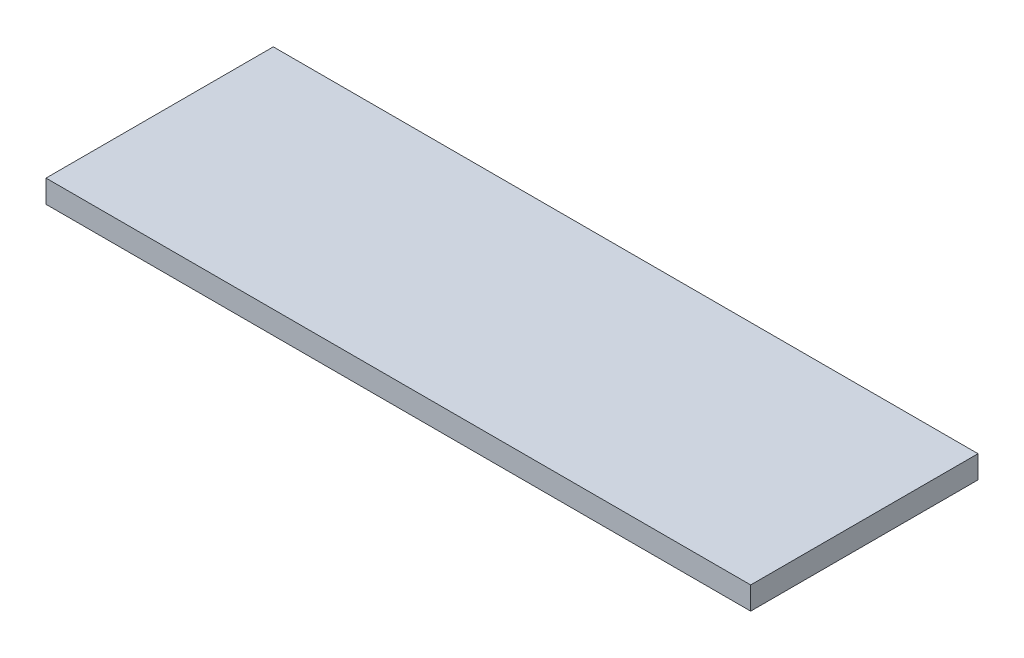
ISO-10303-21;
HEADER;
FILE_DESCRIPTION(('STEP AP214'),'2;1');
FILE_NAME('part.step','',(''),(''),'','','');
FILE_SCHEMA(('AUTOMOTIVE_DESIGN { 1 0 10303 214 1 1 1 1 }'));
ENDSEC;
DATA;
#1=APPLICATION_CONTEXT('core data for automotive mechanical design processes');
#2=APPLICATION_PROTOCOL_DEFINITION('international standard','automotive_design',2000,#1);
#3=PRODUCT_CONTEXT('',#1,'mechanical');
#4=PRODUCT('Part','Part','',(#3));
#5=PRODUCT_RELATED_PRODUCT_CATEGORY('part','',(#4));
#6=PRODUCT_DEFINITION_FORMATION('','',#4);
#7=PRODUCT_DEFINITION_CONTEXT('part definition',#1,'design');
#8=PRODUCT_DEFINITION('design','',#6,#7);
#9=PRODUCT_DEFINITION_SHAPE('','',#8);
#10=(LENGTH_UNIT() NAMED_UNIT(*) SI_UNIT(.MILLI.,.METRE.));
#11=(NAMED_UNIT(*) PLANE_ANGLE_UNIT() SI_UNIT($,.RADIAN.));
#12=(NAMED_UNIT(*) SI_UNIT($,.STERADIAN.) SOLID_ANGLE_UNIT());
#13=UNCERTAINTY_MEASURE_WITH_UNIT(LENGTH_MEASURE(1.E-05),#10,'distance_accuracy_value','');
#14=(GEOMETRIC_REPRESENTATION_CONTEXT(3) GLOBAL_UNCERTAINTY_ASSIGNED_CONTEXT((#13)) GLOBAL_UNIT_ASSIGNED_CONTEXT((#10,
#11,#12)) REPRESENTATION_CONTEXT('',''));
#15=CARTESIAN_POINT('',(0.,0.,0.));
#16=DIRECTION('',(0.,0.,1.));
#17=DIRECTION('',(1.,0.,0.));
#18=AXIS2_PLACEMENT_3D('',#15,#16,#17);
#19=CARTESIAN_POINT('',(-155.,10.,-50.));
#20=DIRECTION('',(1.,0.,0.));
#21=DIRECTION('',(0.,0.,-1.));
#22=AXIS2_PLACEMENT_3D('',#19,#20,#21);
#23=PLANE('',#22);
#24=DIRECTION('',(0.,0.,1.));
#25=VECTOR('',#24,1.);
#26=CARTESIAN_POINT('',(-155.,0.,-50.));
#27=LINE('',#26,#25);
#28=CARTESIAN_POINT('',(-155.,0.,-50.));
#29=VERTEX_POINT('',#28);
#30=CARTESIAN_POINT('',(-155.,0.,50.));
#31=VERTEX_POINT('',#30);
#32=EDGE_CURVE('E96',#29,#31,#27,.T.);
#33=ORIENTED_EDGE('',*,*,#32,.T.);
#34=DIRECTION('',(0.,-1.,0.));
#35=VECTOR('',#34,1.);
#36=CARTESIAN_POINT('',(-155.,10.,50.));
#37=LINE('',#36,#35);
#38=CARTESIAN_POINT('',(-155.,10.,50.));
#39=VERTEX_POINT('',#38);
#40=EDGE_CURVE('E11',#39,#31,#37,.T.);
#41=ORIENTED_EDGE('',*,*,#40,.F.);
#42=DIRECTION('',(0.,0.,1.));
#43=VECTOR('',#42,1.);
#44=CARTESIAN_POINT('',(-155.,10.,-50.));
#45=LINE('',#44,#43);
#46=CARTESIAN_POINT('',(-155.,10.,-50.));
#47=VERTEX_POINT('',#46);
#48=EDGE_CURVE('E84',#47,#39,#45,.T.);
#49=ORIENTED_EDGE('',*,*,#48,.F.);
#50=DIRECTION('',(0.,-1.,0.));
#51=VECTOR('',#50,1.);
#52=CARTESIAN_POINT('',(-155.,10.,-50.));
#53=LINE('',#52,#51);
#54=EDGE_CURVE('E92',#47,#29,#53,.T.);
#55=ORIENTED_EDGE('',*,*,#54,.T.);
#56=EDGE_LOOP('',(#33,#41,#49,#55));
#57=FACE_BOUND('',#56,.T.);
#58=ADVANCED_FACE('F33',(#57),#23,.F.);
#59=CARTESIAN_POINT('',(-155.,10.,50.));
#60=DIRECTION('',(0.,0.,-1.));
#61=DIRECTION('',(-1.,0.,0.));
#62=AXIS2_PLACEMENT_3D('',#59,#60,#61);
#63=PLANE('',#62);
#64=DIRECTION('',(1.,0.,0.));
#65=VECTOR('',#64,1.);
#66=CARTESIAN_POINT('',(-155.,0.,50.));
#67=LINE('',#66,#65);
#68=CARTESIAN_POINT('',(155.,0.,50.));
#69=VERTEX_POINT('',#68);
#70=EDGE_CURVE('E88',#31,#69,#67,.T.);
#71=ORIENTED_EDGE('',*,*,#70,.T.);
#72=DIRECTION('',(0.,-1.,0.));
#73=VECTOR('',#72,1.);
#74=CARTESIAN_POINT('',(155.,10.,50.));
#75=LINE('',#74,#73);
#76=CARTESIAN_POINT('',(155.,10.,50.));
#77=VERTEX_POINT('',#76);
#78=EDGE_CURVE('E41',#77,#69,#75,.T.);
#79=ORIENTED_EDGE('',*,*,#78,.F.);
#80=DIRECTION('',(1.,0.,0.));
#81=VECTOR('',#80,1.);
#82=CARTESIAN_POINT('',(-155.,10.,50.));
#83=LINE('',#82,#81);
#84=EDGE_CURVE('E79',#39,#77,#83,.T.);
#85=ORIENTED_EDGE('',*,*,#84,.F.);
#86=ORIENTED_EDGE('',*,*,#40,.T.);
#87=EDGE_LOOP('',(#71,#79,#85,#86));
#88=FACE_BOUND('',#87,.T.);
#89=ADVANCED_FACE('F87',(#88),#63,.F.);
#90=CARTESIAN_POINT('',(155.,10.,-50.));
#91=DIRECTION('',(-1.,0.,0.));
#92=DIRECTION('',(0.,0.,1.));
#93=AXIS2_PLACEMENT_3D('',#90,#91,#92);
#94=PLANE('',#93);
#95=DIRECTION('',(0.,0.,-1.));
#96=VECTOR('',#95,1.);
#97=CARTESIAN_POINT('',(155.,0.,-50.));
#98=LINE('',#97,#96);
#99=CARTESIAN_POINT('',(155.,0.,-50.));
#100=VERTEX_POINT('',#99);
#101=EDGE_CURVE('E66',#69,#100,#98,.T.);
#102=ORIENTED_EDGE('',*,*,#101,.T.);
#103=DIRECTION('',(0.,-1.,0.));
#104=VECTOR('',#103,1.);
#105=CARTESIAN_POINT('',(155.,10.,-50.));
#106=LINE('',#105,#104);
#107=CARTESIAN_POINT('',(155.,10.,-50.));
#108=VERTEX_POINT('',#107);
#109=EDGE_CURVE('E89',#108,#100,#106,.T.);
#110=ORIENTED_EDGE('',*,*,#109,.F.);
#111=DIRECTION('',(0.,0.,-1.));
#112=VECTOR('',#111,1.);
#113=CARTESIAN_POINT('',(155.,10.,-50.));
#114=LINE('',#113,#112);
#115=EDGE_CURVE('E82',#77,#108,#114,.T.);
#116=ORIENTED_EDGE('',*,*,#115,.F.);
#117=ORIENTED_EDGE('',*,*,#78,.T.);
#118=EDGE_LOOP('',(#102,#110,#116,#117));
#119=FACE_BOUND('',#118,.T.);
#120=ADVANCED_FACE('F90',(#119),#94,.F.);
#121=CARTESIAN_POINT('',(-155.,10.,-50.));
#122=DIRECTION('',(0.,0.,1.));
#123=DIRECTION('',(1.,0.,0.));
#124=AXIS2_PLACEMENT_3D('',#121,#122,#123);
#125=PLANE('',#124);
#126=DIRECTION('',(-1.,0.,0.));
#127=VECTOR('',#126,1.);
#128=CARTESIAN_POINT('',(-155.,0.,-50.));
#129=LINE('',#128,#127);
#130=EDGE_CURVE('E72',#100,#29,#129,.T.);
#131=ORIENTED_EDGE('',*,*,#130,.T.);
#132=ORIENTED_EDGE('',*,*,#54,.F.);
#133=DIRECTION('',(-1.,0.,0.));
#134=VECTOR('',#133,1.);
#135=CARTESIAN_POINT('',(-155.,10.,-50.));
#136=LINE('',#135,#134);
#137=EDGE_CURVE('E49',#108,#47,#136,.T.);
#138=ORIENTED_EDGE('',*,*,#137,.F.);
#139=ORIENTED_EDGE('',*,*,#109,.T.);
#140=EDGE_LOOP('',(#131,#132,#138,#139));
#141=FACE_BOUND('',#140,.T.);
#142=ADVANCED_FACE('F103',(#141),#125,.F.);
#143=CARTESIAN_POINT('',(0.,10.,0.));
#144=DIRECTION('',(0.,1.,0.));
#145=DIRECTION('',(0.,0.,1.));
#146=AXIS2_PLACEMENT_3D('',#143,#144,#145);
#147=PLANE('',#146);
#148=ORIENTED_EDGE('',*,*,#48,.T.);
#149=ORIENTED_EDGE('',*,*,#84,.T.);
#150=ORIENTED_EDGE('',*,*,#115,.T.);
#151=ORIENTED_EDGE('',*,*,#137,.T.);
#152=EDGE_LOOP('',(#148,#149,#150,#151));
#153=FACE_BOUND('',#152,.T.);
#154=ADVANCED_FACE('F80',(#153),#147,.T.);
#155=CARTESIAN_POINT('',(0.,0.,0.));
#156=DIRECTION('',(0.,1.,0.));
#157=DIRECTION('',(0.,0.,1.));
#158=AXIS2_PLACEMENT_3D('',#155,#156,#157);
#159=PLANE('',#158);
#160=ORIENTED_EDGE('',*,*,#32,.F.);
#161=ORIENTED_EDGE('',*,*,#130,.F.);
#162=ORIENTED_EDGE('',*,*,#101,.F.);
#163=ORIENTED_EDGE('',*,*,#70,.F.);
#164=EDGE_LOOP('',(#160,#161,#162,#163));
#165=FACE_BOUND('',#164,.T.);
#166=ADVANCED_FACE('F106',(#165),#159,.F.);
#167=CLOSED_SHELL('',(#58,#89,#120,#142,#154,#166));
#168=MANIFOLD_SOLID_BREP('B2',#167);
#169=ADVANCED_BREP_SHAPE_REPRESENTATION('',(#18,#168),#14);
#170=SHAPE_DEFINITION_REPRESENTATION(#9,#169);
ENDSEC;
END-ISO-10303-21;
